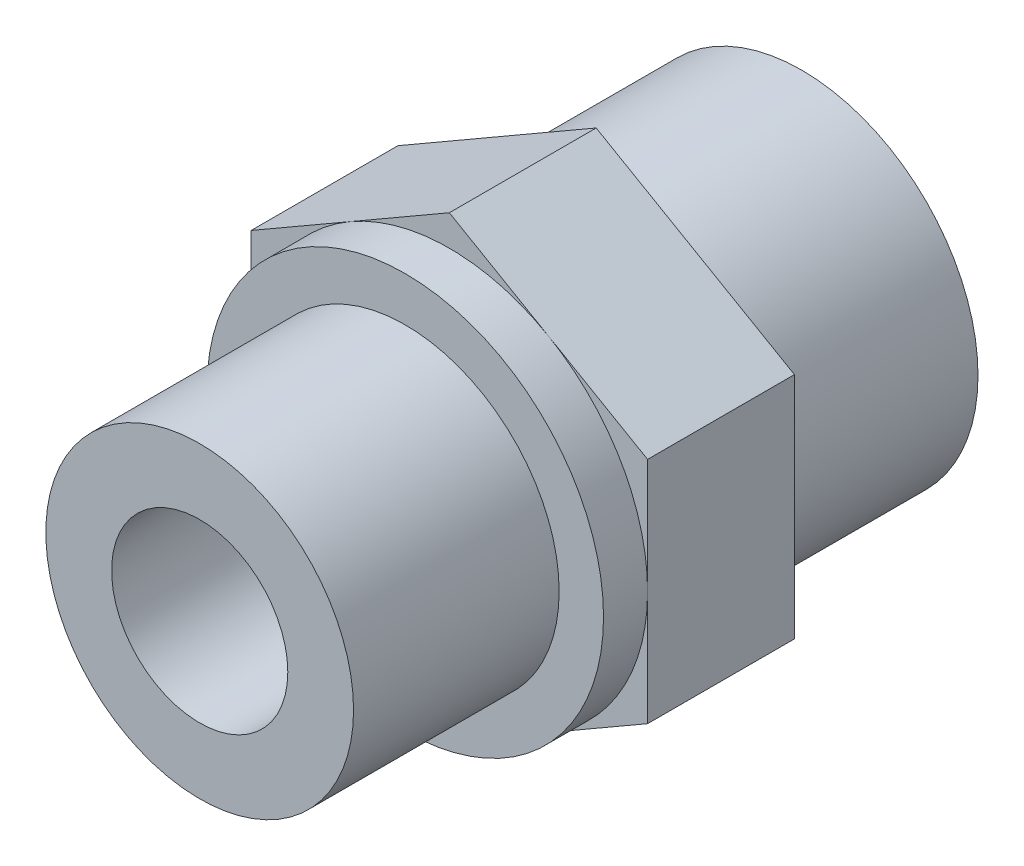
ISO-10303-21;
HEADER;
FILE_DESCRIPTION(('STEP AP214'),'2;1');
FILE_NAME('part.step','',(''),(''),'','','');
FILE_SCHEMA(('AUTOMOTIVE_DESIGN { 1 0 10303 214 1 1 1 1 }'));
ENDSEC;
DATA;
#1=APPLICATION_CONTEXT('core data for automotive mechanical design processes');
#2=APPLICATION_PROTOCOL_DEFINITION('international standard','automotive_design',2000,#1);
#3=PRODUCT_CONTEXT('',#1,'mechanical');
#4=PRODUCT('Part','Part','',(#3));
#5=PRODUCT_RELATED_PRODUCT_CATEGORY('part','',(#4));
#6=PRODUCT_DEFINITION_FORMATION('','',#4);
#7=PRODUCT_DEFINITION_CONTEXT('part definition',#1,'design');
#8=PRODUCT_DEFINITION('design','',#6,#7);
#9=PRODUCT_DEFINITION_SHAPE('','',#8);
#10=(LENGTH_UNIT() NAMED_UNIT(*) SI_UNIT(.MILLI.,.METRE.));
#11=(NAMED_UNIT(*) PLANE_ANGLE_UNIT() SI_UNIT($,.RADIAN.));
#12=(NAMED_UNIT(*) SI_UNIT($,.STERADIAN.) SOLID_ANGLE_UNIT());
#13=UNCERTAINTY_MEASURE_WITH_UNIT(LENGTH_MEASURE(1.E-05),#10,'distance_accuracy_value','');
#14=(GEOMETRIC_REPRESENTATION_CONTEXT(3) GLOBAL_UNCERTAINTY_ASSIGNED_CONTEXT((#13)) GLOBAL_UNIT_ASSIGNED_CONTEXT((#10,
#11,#12)) REPRESENTATION_CONTEXT('',''));
#15=CARTESIAN_POINT('',(0.,0.,0.));
#16=DIRECTION('',(0.,0.,1.));
#17=DIRECTION('',(1.,0.,0.));
#18=AXIS2_PLACEMENT_3D('',#15,#16,#17);
#19=CARTESIAN_POINT('',(-2.22044604925031E-13,1.4432899320127E-12,-14.0000000000002));
#20=DIRECTION('',(0.,0.,-1.));
#21=DIRECTION('',(-1.,0.,0.));
#22=AXIS2_PLACEMENT_3D('',#19,#20,#21);
#23=PLANE('',#22);
#24=CARTESIAN_POINT('',(-2.22044604925031E-13,1.4432899320127E-12,-14.0000000000002));
#25=DIRECTION('',(0.,0.,-1.));
#26=DIRECTION('',(-1.,0.,0.));
#27=AXIS2_PLACEMENT_3D('',#24,#25,#26);
#28=CIRCLE('',#27,12.);
#29=CARTESIAN_POINT('',(-12.0000000000002,1.4432899320127E-12,-14.0000000000002));
#30=VERTEX_POINT('',#29);
#31=EDGE_CURVE('E266',#30,#30,#28,.T.);
#32=ORIENTED_EDGE('',*,*,#31,.T.);
#33=EDGE_LOOP('',(#32));
#34=FACE_BOUND('',#33,.T.);
#35=CARTESIAN_POINT('',(-2.22044604925031E-13,1.4432899320127E-12,-14.0000000000002));
#36=DIRECTION('',(0.,0.,1.));
#37=DIRECTION('',(1.,0.,0.));
#38=AXIS2_PLACEMENT_3D('',#35,#36,#37);
#39=CIRCLE('',#38,9.15);
#40=CARTESIAN_POINT('',(9.14999999999978,1.4432899320127E-12,-14.0000000000002));
#41=VERTEX_POINT('',#40);
#42=EDGE_CURVE('E274',#41,#41,#39,.T.);
#43=ORIENTED_EDGE('',*,*,#42,.T.);
#44=EDGE_LOOP('',(#43));
#45=FACE_BOUND('',#44,.T.);
#46=ADVANCED_FACE('F34',(#34,#45),#23,.T.);
#47=CARTESIAN_POINT('',(2.22044604925031E-13,1.27675647831893E-12,-14.0000000000001));
#48=DIRECTION('',(0.,0.,1.));
#49=DIRECTION('',(1.,0.,0.));
#50=AXIS2_PLACEMENT_3D('',#47,#48,#49);
#51=CYLINDRICAL_SURFACE('',#50,6.);
#52=CARTESIAN_POINT('',(0.,1.60982338570648E-12,26.9999999999997));
#53=DIRECTION('',(0.,0.,1.));
#54=DIRECTION('',(1.,0.,0.));
#55=AXIS2_PLACEMENT_3D('',#52,#53,#54);
#56=CIRCLE('',#55,6.);
#57=CARTESIAN_POINT('',(6.,1.60982338570648E-12,26.9999999999997));
#58=VERTEX_POINT('',#57);
#59=EDGE_CURVE('E269',#58,#58,#56,.T.);
#60=ORIENTED_EDGE('',*,*,#59,.T.);
#61=EDGE_LOOP('',(#60));
#62=FACE_BOUND('',#61,.T.);
#63=CARTESIAN_POINT('',(0.,1.72084568816899E-12,-5.50000000000001));
#64=DIRECTION('',(0.,0.,-1.));
#65=DIRECTION('',(-1.,0.,0.));
#66=AXIS2_PLACEMENT_3D('',#63,#64,#65);
#67=CIRCLE('',#66,6.);
#68=CARTESIAN_POINT('',(-6.,1.72084568816899E-12,-5.50000000000001));
#69=VERTEX_POINT('',#68);
#70=EDGE_CURVE('E38',#69,#69,#67,.F.);
#71=ORIENTED_EDGE('',*,*,#70,.F.);
#72=EDGE_LOOP('',(#71));
#73=FACE_BOUND('',#72,.T.);
#74=ADVANCED_FACE('F226',(#62,#73),#51,.F.);
#75=CARTESIAN_POINT('',(-13.5000000000001,23.3826859021811,-4.44089209850063E-13));
#76=DIRECTION('',(0.,0.,1.));
#77=DIRECTION('',(1.,0.,0.));
#78=AXIS2_PLACEMENT_3D('',#75,#76,#77);
#79=PLANE('',#78);
#80=DIRECTION('',(-0.866025403784438,0.499999999999998,0.));
#81=VECTOR('',#80,1.);
#82=CARTESIAN_POINT('',(13.4999999999998,7.79422863406098,-6.66133814775094E-13));
#83=LINE('',#82,#81);
#84=CARTESIAN_POINT('',(13.4999999999998,7.79422863406098,-6.66133814775094E-13));
#85=VERTEX_POINT('',#84);
#86=CARTESIAN_POINT('',(2.22044604925031E-13,15.5884572681207,-6.10622663543836E-13));
#87=VERTEX_POINT('',#86);
#88=EDGE_CURVE('E157',#85,#87,#83,.T.);
#89=ORIENTED_EDGE('',*,*,#88,.F.);
#90=DIRECTION('',(0.,0.999999999999997,0.));
#91=VECTOR('',#90,1.);
#92=CARTESIAN_POINT('',(13.4999999999995,-7.79422863405849,-3.33066907387547E-13));
#93=LINE('',#92,#91);
#94=CARTESIAN_POINT('',(13.4999999999995,-7.79422863405849,-3.33066907387547E-13));
#95=VERTEX_POINT('',#94);
#96=EDGE_CURVE('E168',#95,#85,#93,.T.);
#97=ORIENTED_EDGE('',*,*,#96,.F.);
#98=DIRECTION('',(0.866025403784439,0.499999999999997,0.));
#99=VECTOR('',#98,1.);
#100=CARTESIAN_POINT('',(-4.44089209850063E-13,-15.588457268119,-6.10622663543836E-13));
#101=LINE('',#100,#99);
#102=CARTESIAN_POINT('',(-4.44089209850063E-13,-15.588457268119,-6.10622663543836E-13));
#103=VERTEX_POINT('',#102);
#104=EDGE_CURVE('E166',#103,#95,#101,.T.);
#105=ORIENTED_EDGE('',*,*,#104,.F.);
#106=DIRECTION('',(0.866025403784439,-0.499999999999999,0.));
#107=VECTOR('',#106,1.);
#108=CARTESIAN_POINT('',(-13.5000000000003,-7.7942286340586,-5.55111512312578E-13));
#109=LINE('',#108,#107);
#110=CARTESIAN_POINT('',(-13.5000000000003,-7.7942286340586,-5.55111512312578E-13));
#111=VERTEX_POINT('',#110);
#112=EDGE_CURVE('E164',#111,#103,#109,.T.);
#113=ORIENTED_EDGE('',*,*,#112,.F.);
#114=DIRECTION('',(0.,-0.999999999999997,0.));
#115=VECTOR('',#114,1.);
#116=CARTESIAN_POINT('',(-13.4999999999998,7.79422863406137,-3.33066907387547E-13));
#117=LINE('',#116,#115);
#118=CARTESIAN_POINT('',(-13.4999999999998,7.79422863406137,-3.33066907387547E-13));
#119=VERTEX_POINT('',#118);
#120=EDGE_CURVE('E162',#119,#111,#117,.T.);
#121=ORIENTED_EDGE('',*,*,#120,.F.);
#122=DIRECTION('',(-0.866025403784438,-0.499999999999998,0.));
#123=VECTOR('',#122,1.);
#124=CARTESIAN_POINT('',(2.22044604925031E-13,15.5884572681207,-6.10622663543836E-13));
#125=LINE('',#124,#123);
#126=EDGE_CURVE('E160',#87,#119,#125,.T.);
#127=ORIENTED_EDGE('',*,*,#126,.F.);
#128=EDGE_LOOP('',(#89,#97,#105,#113,#121,#127));
#129=FACE_BOUND('',#128,.T.);
#130=CARTESIAN_POINT('',(-2.22044604925031E-13,9.43689570931383E-13,-1.66533453693773E-13));
#131=DIRECTION('',(0.,0.,1.));
#132=DIRECTION('',(1.,0.,0.));
#133=AXIS2_PLACEMENT_3D('',#130,#131,#132);
#134=CIRCLE('',#133,12.);
#135=CARTESIAN_POINT('',(11.9999999999998,9.43689570931383E-13,-1.66734131172478E-13));
#136=VERTEX_POINT('',#135);
#137=EDGE_CURVE('E11',#136,#136,#134,.F.);
#138=ORIENTED_EDGE('',*,*,#137,.F.);
#139=EDGE_LOOP('',(#138));
#140=FACE_BOUND('',#139,.T.);
#141=ADVANCED_FACE('F192',(#129,#140),#79,.F.);
#142=CARTESIAN_POINT('',(2.22044604925031E-13,1.27675647831893E-12,13.));
#143=DIRECTION('',(0.,0.,1.));
#144=DIRECTION('',(1.,0.,0.));
#145=AXIS2_PLACEMENT_3D('',#142,#143,#144);
#146=PLANE('',#145);
#147=CARTESIAN_POINT('',(2.22044604925031E-13,1.27675647831893E-12,13.));
#148=DIRECTION('',(0.,0.,1.));
#149=DIRECTION('',(1.,0.,0.));
#150=AXIS2_PLACEMENT_3D('',#147,#148,#149);
#151=CIRCLE('',#150,13.5);
#152=CARTESIAN_POINT('',(13.5000000000002,1.27675647831893E-12,13.));
#153=VERTEX_POINT('',#152);
#154=EDGE_CURVE('E129',#153,#153,#151,.T.);
#155=ORIENTED_EDGE('',*,*,#154,.T.);
#156=EDGE_LOOP('',(#155));
#157=FACE_BOUND('',#156,.T.);
#158=CARTESIAN_POINT('',(2.22044604925031E-13,1.27675647831893E-12,13.));
#159=DIRECTION('',(0.,0.,1.));
#160=DIRECTION('',(1.,0.,0.));
#161=AXIS2_PLACEMENT_3D('',#158,#159,#160);
#162=CIRCLE('',#161,10.4775);
#163=CARTESIAN_POINT('',(10.4775000000002,1.27675647831893E-12,13.));
#164=VERTEX_POINT('',#163);
#165=EDGE_CURVE('E264',#164,#164,#162,.T.);
#166=ORIENTED_EDGE('',*,*,#165,.F.);
#167=EDGE_LOOP('',(#166));
#168=FACE_BOUND('',#167,.T.);
#169=ADVANCED_FACE('F251',(#157,#168),#146,.T.);
#170=CARTESIAN_POINT('',(-13.5000000000007,23.3826859021808,9.99999999999945));
#171=DIRECTION('',(0.,0.,1.));
#172=DIRECTION('',(1.,0.,0.));
#173=AXIS2_PLACEMENT_3D('',#170,#171,#172);
#174=PLANE('',#173);
#175=CARTESIAN_POINT('',(-2.22044604925031E-13,8.88178419700125E-13,9.99999999999973));
#176=DIRECTION('',(0.,0.,1.));
#177=DIRECTION('',(1.,0.,0.));
#178=AXIS2_PLACEMENT_3D('',#175,#176,#177);
#179=CIRCLE('',#178,13.5);
#180=CARTESIAN_POINT('',(13.4999999999992,1.11022302462516E-12,9.99999999999951));
#181=VERTEX_POINT('',#180);
#182=CARTESIAN_POINT('',(6.74999999999937,11.6913429510913,9.99999999999945));
#183=VERTEX_POINT('',#182);
#184=EDGE_CURVE('E124',#181,#183,#179,.T.);
#185=ORIENTED_EDGE('',*,*,#184,.F.);
#186=DIRECTION('',(0.,0.999999999999997,0.));
#187=VECTOR('',#186,1.);
#188=CARTESIAN_POINT('',(13.5000000000001,-7.79422863405899,9.99999999999968));
#189=LINE('',#188,#187);
#190=CARTESIAN_POINT('',(13.4999999999993,7.79422863406093,9.99999999999934));
#191=VERTEX_POINT('',#190);
#192=EDGE_CURVE('E113',#181,#191,#189,.T.);
#193=ORIENTED_EDGE('',*,*,#192,.T.);
#194=DIRECTION('',(-0.866025403784438,0.499999999999998,0.));
#195=VECTOR('',#194,1.);
#196=CARTESIAN_POINT('',(13.4999999999993,7.79422863406093,9.99999999999934));
#197=LINE('',#196,#195);
#198=EDGE_CURVE('E126',#191,#183,#197,.T.);
#199=ORIENTED_EDGE('',*,*,#198,.T.);
#200=EDGE_LOOP('',(#185,#193,#199));
#201=FACE_BOUND('',#200,.T.);
#202=ADVANCED_FACE('F125',(#201),#174,.T.);
#203=CARTESIAN_POINT('',(-6.7500000000007,11.6913429510908,9.99999999999918));
#204=VERTEX_POINT('',#203);
#205=EDGE_CURVE('E43',#183,#204,#179,.T.);
#206=ORIENTED_EDGE('',*,*,#205,.F.);
#207=CARTESIAN_POINT('',(-2.22044604925031E-13,15.5884572681211,9.99999999999945));
#208=VERTEX_POINT('',#207);
#209=EDGE_CURVE('E144',#183,#208,#197,.T.);
#210=ORIENTED_EDGE('',*,*,#209,.T.);
#211=DIRECTION('',(-0.866025403784438,-0.499999999999998,0.));
#212=VECTOR('',#211,1.);
#213=CARTESIAN_POINT('',(-2.22044604925031E-13,15.5884572681211,9.99999999999945));
#214=LINE('',#213,#212);
#215=EDGE_CURVE('E145',#208,#204,#214,.T.);
#216=ORIENTED_EDGE('',*,*,#215,.T.);
#217=EDGE_LOOP('',(#206,#210,#216));
#218=FACE_BOUND('',#217,.T.);
#219=ADVANCED_FACE('F210',(#218),#174,.T.);
#220=CARTESIAN_POINT('',(-13.5000000000001,9.43689570931383E-13,9.99999999999984));
#221=VERTEX_POINT('',#220);
#222=EDGE_CURVE('E207',#204,#221,#179,.T.);
#223=ORIENTED_EDGE('',*,*,#222,.F.);
#224=CARTESIAN_POINT('',(-13.5000000000007,7.79422863406093,9.99999999999956));
#225=VERTEX_POINT('',#224);
#226=EDGE_CURVE('E143',#204,#225,#214,.T.);
#227=ORIENTED_EDGE('',*,*,#226,.T.);
#228=DIRECTION('',(0.,-0.999999999999997,0.));
#229=VECTOR('',#228,1.);
#230=CARTESIAN_POINT('',(-13.5000000000007,7.79422863406093,9.99999999999956));
#231=LINE('',#230,#229);
#232=EDGE_CURVE('E149',#225,#221,#231,.T.);
#233=ORIENTED_EDGE('',*,*,#232,.T.);
#234=EDGE_LOOP('',(#223,#227,#233));
#235=FACE_BOUND('',#234,.T.);
#236=ADVANCED_FACE('F216',(#235),#174,.T.);
#237=CARTESIAN_POINT('',(-6.75000000000092,-11.6913429510886,9.99999999999956));
#238=VERTEX_POINT('',#237);
#239=EDGE_CURVE('E135',#221,#238,#179,.T.);
#240=ORIENTED_EDGE('',*,*,#239,.F.);
#241=CARTESIAN_POINT('',(-13.5000000000005,-7.79422863405849,9.9999999999994));
#242=VERTEX_POINT('',#241);
#243=EDGE_CURVE('E148',#221,#242,#231,.T.);
#244=ORIENTED_EDGE('',*,*,#243,.T.);
#245=DIRECTION('',(0.866025403784439,-0.499999999999999,0.));
#246=VECTOR('',#245,1.);
#247=CARTESIAN_POINT('',(-13.5000000000005,-7.79422863405849,9.9999999999994));
#248=LINE('',#247,#246);
#249=EDGE_CURVE('E153',#242,#238,#248,.T.);
#250=ORIENTED_EDGE('',*,*,#249,.T.);
#251=EDGE_LOOP('',(#240,#244,#250));
#252=FACE_BOUND('',#251,.T.);
#253=ADVANCED_FACE('F205',(#252),#174,.T.);
#254=CARTESIAN_POINT('',(6.74999999999915,-11.6913429510884,9.99999999999968));
#255=VERTEX_POINT('',#254);
#256=EDGE_CURVE('E58',#238,#255,#179,.T.);
#257=ORIENTED_EDGE('',*,*,#256,.F.);
#258=CARTESIAN_POINT('',(-8.88178419700125E-13,-15.5884572681189,9.99999999999945));
#259=VERTEX_POINT('',#258);
#260=EDGE_CURVE('E152',#238,#259,#248,.T.);
#261=ORIENTED_EDGE('',*,*,#260,.T.);
#262=DIRECTION('',(0.866025403784439,0.499999999999997,0.));
#263=VECTOR('',#262,1.);
#264=CARTESIAN_POINT('',(-8.88178419700125E-13,-15.5884572681189,9.99999999999945));
#265=LINE('',#264,#263);
#266=EDGE_CURVE('E122',#259,#255,#265,.T.);
#267=ORIENTED_EDGE('',*,*,#266,.T.);
#268=EDGE_LOOP('',(#257,#261,#267));
#269=FACE_BOUND('',#268,.T.);
#270=ADVANCED_FACE('F203',(#269),#174,.T.);
#271=CARTESIAN_POINT('',(13.4999999999993,7.79422863406093,9.99999999999934));
#272=DIRECTION('',(-0.5,-0.866025403784436,0.));
#273=DIRECTION('',(0.866025403784438,-0.499999999999998,0.));
#274=AXIS2_PLACEMENT_3D('',#271,#272,#273);
#275=PLANE('',#274);
#276=ORIENTED_EDGE('',*,*,#88,.T.);
#277=DIRECTION('',(0.,0.,-1.));
#278=VECTOR('',#277,1.);
#279=CARTESIAN_POINT('',(-2.22044604925031E-13,15.5884572681211,9.99999999999945));
#280=LINE('',#279,#278);
#281=EDGE_CURVE('E134',#208,#87,#280,.T.);
#282=ORIENTED_EDGE('',*,*,#281,.F.);
#283=ORIENTED_EDGE('',*,*,#209,.F.);
#284=ORIENTED_EDGE('',*,*,#198,.F.);
#285=DIRECTION('',(0.,0.,-1.));
#286=VECTOR('',#285,1.);
#287=CARTESIAN_POINT('',(13.4999999999993,7.79422863406093,9.99999999999934));
#288=LINE('',#287,#286);
#289=EDGE_CURVE('E112',#191,#85,#288,.T.);
#290=ORIENTED_EDGE('',*,*,#289,.T.);
#291=EDGE_LOOP('',(#276,#282,#283,#284,#290));
#292=FACE_BOUND('',#291,.T.);
#293=ADVANCED_FACE('F36',(#292),#275,.F.);
#294=CARTESIAN_POINT('',(-2.22044604925031E-13,15.5884572681211,9.99999999999945));
#295=DIRECTION('',(0.499999999999999,-0.866025403784436,0.));
#296=DIRECTION('',(0.866025403784438,0.499999999999998,0.));
#297=AXIS2_PLACEMENT_3D('',#294,#295,#296);
#298=PLANE('',#297);
#299=ORIENTED_EDGE('',*,*,#126,.T.);
#300=DIRECTION('',(0.,0.,-1.));
#301=VECTOR('',#300,1.);
#302=CARTESIAN_POINT('',(-13.5000000000007,7.79422863406093,9.99999999999956));
#303=LINE('',#302,#301);
#304=EDGE_CURVE('E137',#225,#119,#303,.T.);
#305=ORIENTED_EDGE('',*,*,#304,.F.);
#306=ORIENTED_EDGE('',*,*,#226,.F.);
#307=ORIENTED_EDGE('',*,*,#215,.F.);
#308=ORIENTED_EDGE('',*,*,#281,.T.);
#309=EDGE_LOOP('',(#299,#305,#306,#307,#308));
#310=FACE_BOUND('',#309,.T.);
#311=ADVANCED_FACE('F214',(#310),#298,.F.);
#312=CARTESIAN_POINT('',(-13.5000000000007,7.79422863406093,9.99999999999956));
#313=DIRECTION('',(1.,0.,0.));
#314=DIRECTION('',(0.,0.,-1.));
#315=AXIS2_PLACEMENT_3D('',#312,#313,#314);
#316=PLANE('',#315);
#317=ORIENTED_EDGE('',*,*,#120,.T.);
#318=DIRECTION('',(0.,0.,-1.));
#319=VECTOR('',#318,1.);
#320=CARTESIAN_POINT('',(-13.5000000000005,-7.79422863405849,9.9999999999994));
#321=LINE('',#320,#319);
#322=EDGE_CURVE('E176',#242,#111,#321,.T.);
#323=ORIENTED_EDGE('',*,*,#322,.F.);
#324=ORIENTED_EDGE('',*,*,#243,.F.);
#325=ORIENTED_EDGE('',*,*,#232,.F.);
#326=ORIENTED_EDGE('',*,*,#304,.T.);
#327=EDGE_LOOP('',(#317,#323,#324,#325,#326));
#328=FACE_BOUND('',#327,.T.);
#329=ADVANCED_FACE('F184',(#328),#316,.F.);
#330=CARTESIAN_POINT('',(-13.5000000000005,-7.79422863405849,9.9999999999994));
#331=DIRECTION('',(0.5,0.866025403784436,0.));
#332=DIRECTION('',(-0.866025403784439,0.499999999999999,0.));
#333=AXIS2_PLACEMENT_3D('',#330,#331,#332);
#334=PLANE('',#333);
#335=ORIENTED_EDGE('',*,*,#112,.T.);
#336=DIRECTION('',(0.,0.,-1.));
#337=VECTOR('',#336,1.);
#338=CARTESIAN_POINT('',(-8.88178419700125E-13,-15.5884572681189,9.99999999999945));
#339=LINE('',#338,#337);
#340=EDGE_CURVE('E173',#259,#103,#339,.T.);
#341=ORIENTED_EDGE('',*,*,#340,.F.);
#342=ORIENTED_EDGE('',*,*,#260,.F.);
#343=ORIENTED_EDGE('',*,*,#249,.F.);
#344=ORIENTED_EDGE('',*,*,#322,.T.);
#345=EDGE_LOOP('',(#335,#341,#342,#343,#344));
#346=FACE_BOUND('',#345,.T.);
#347=ADVANCED_FACE('F198',(#346),#334,.F.);
#348=CARTESIAN_POINT('',(-8.88178419700125E-13,-15.5884572681189,9.99999999999945));
#349=DIRECTION('',(-0.499999999999999,0.866025403784436,0.));
#350=DIRECTION('',(-0.866025403784439,-0.499999999999997,0.));
#351=AXIS2_PLACEMENT_3D('',#348,#349,#350);
#352=PLANE('',#351);
#353=ORIENTED_EDGE('',*,*,#104,.T.);
#354=DIRECTION('',(0.,0.,-1.));
#355=VECTOR('',#354,1.);
#356=CARTESIAN_POINT('',(13.5000000000001,-7.79422863405899,9.99999999999968));
#357=LINE('',#356,#355);
#358=CARTESIAN_POINT('',(13.5000000000001,-7.79422863405899,9.99999999999968));
#359=VERTEX_POINT('',#358);
#360=EDGE_CURVE('E171',#359,#95,#357,.T.);
#361=ORIENTED_EDGE('',*,*,#360,.F.);
#362=EDGE_CURVE('E108',#255,#359,#265,.T.);
#363=ORIENTED_EDGE('',*,*,#362,.F.);
#364=ORIENTED_EDGE('',*,*,#266,.F.);
#365=ORIENTED_EDGE('',*,*,#340,.T.);
#366=EDGE_LOOP('',(#353,#361,#363,#364,#365));
#367=FACE_BOUND('',#366,.T.);
#368=ADVANCED_FACE('F202',(#367),#352,.F.);
#369=CARTESIAN_POINT('',(13.5000000000001,-7.79422863405899,9.99999999999968));
#370=DIRECTION('',(-1.,0.,0.));
#371=DIRECTION('',(0.,-0.999999999999997,0.));
#372=AXIS2_PLACEMENT_3D('',#369,#370,#371);
#373=PLANE('',#372);
#374=ORIENTED_EDGE('',*,*,#96,.T.);
#375=ORIENTED_EDGE('',*,*,#289,.F.);
#376=ORIENTED_EDGE('',*,*,#192,.F.);
#377=EDGE_CURVE('E105',#359,#181,#189,.T.);
#378=ORIENTED_EDGE('',*,*,#377,.F.);
#379=ORIENTED_EDGE('',*,*,#360,.T.);
#380=EDGE_LOOP('',(#374,#375,#376,#378,#379));
#381=FACE_BOUND('',#380,.T.);
#382=ADVANCED_FACE('F117',(#381),#373,.F.);
#383=EDGE_CURVE('E50',#255,#181,#179,.T.);
#384=ORIENTED_EDGE('',*,*,#383,.F.);
#385=ORIENTED_EDGE('',*,*,#362,.T.);
#386=ORIENTED_EDGE('',*,*,#377,.T.);
#387=EDGE_LOOP('',(#384,#385,#386));
#388=FACE_BOUND('',#387,.T.);
#389=ADVANCED_FACE('F107',(#388),#174,.T.);
#390=CARTESIAN_POINT('',(2.22044604925031E-13,1.27675647831893E-12,13.));
#391=DIRECTION('',(0.,0.,-1.));
#392=DIRECTION('',(-1.,0.,0.));
#393=AXIS2_PLACEMENT_3D('',#390,#391,#392);
#394=CYLINDRICAL_SURFACE('',#393,13.5);
#395=ORIENTED_EDGE('',*,*,#154,.F.);
#396=EDGE_LOOP('',(#395));
#397=FACE_BOUND('',#396,.T.);
#398=ORIENTED_EDGE('',*,*,#184,.T.);
#399=ORIENTED_EDGE('',*,*,#205,.T.);
#400=ORIENTED_EDGE('',*,*,#222,.T.);
#401=ORIENTED_EDGE('',*,*,#239,.T.);
#402=ORIENTED_EDGE('',*,*,#256,.T.);
#403=ORIENTED_EDGE('',*,*,#383,.T.);
#404=EDGE_LOOP('',(#398,#399,#400,#401,#402,#403));
#405=FACE_BOUND('',#404,.T.);
#406=ADVANCED_FACE('F132',(#397,#405),#394,.T.);
#407=CARTESIAN_POINT('',(0.,1.60982338570648E-12,26.9999999999997));
#408=DIRECTION('',(0.,0.,-1.));
#409=DIRECTION('',(-1.,0.,0.));
#410=AXIS2_PLACEMENT_3D('',#407,#408,#409);
#411=CYLINDRICAL_SURFACE('',#410,10.4775);
#412=CARTESIAN_POINT('',(0.,1.60982338570648E-12,26.9999999999997));
#413=DIRECTION('',(0.,0.,1.));
#414=DIRECTION('',(1.,0.,0.));
#415=AXIS2_PLACEMENT_3D('',#412,#413,#414);
#416=CIRCLE('',#415,10.4775);
#417=CARTESIAN_POINT('',(10.4775,1.60982338570648E-12,26.9999999999997));
#418=VERTEX_POINT('',#417);
#419=EDGE_CURVE('E130',#418,#418,#416,.T.);
#420=ORIENTED_EDGE('',*,*,#419,.F.);
#421=EDGE_LOOP('',(#420));
#422=FACE_BOUND('',#421,.T.);
#423=ORIENTED_EDGE('',*,*,#165,.T.);
#424=EDGE_LOOP('',(#423));
#425=FACE_BOUND('',#424,.T.);
#426=ADVANCED_FACE('F246',(#422,#425),#411,.T.);
#427=CARTESIAN_POINT('',(0.,1.60982338570648E-12,26.9999999999997));
#428=DIRECTION('',(0.,0.,1.));
#429=DIRECTION('',(1.,0.,0.));
#430=AXIS2_PLACEMENT_3D('',#427,#428,#429);
#431=PLANE('',#430);
#432=ORIENTED_EDGE('',*,*,#59,.F.);
#433=EDGE_LOOP('',(#432));
#434=FACE_BOUND('',#433,.T.);
#435=ORIENTED_EDGE('',*,*,#419,.T.);
#436=EDGE_LOOP('',(#435));
#437=FACE_BOUND('',#436,.T.);
#438=ADVANCED_FACE('F242',(#434,#437),#431,.T.);
#439=CARTESIAN_POINT('',(-2.22044604925031E-13,1.4432899320127E-12,-14.0000000000002));
#440=DIRECTION('',(0.,0.,1.));
#441=DIRECTION('',(1.,0.,0.));
#442=AXIS2_PLACEMENT_3D('',#439,#440,#441);
#443=CYLINDRICAL_SURFACE('',#442,12.);
#444=ORIENTED_EDGE('',*,*,#31,.F.);
#445=EDGE_LOOP('',(#444));
#446=FACE_BOUND('',#445,.T.);
#447=ORIENTED_EDGE('',*,*,#137,.T.);
#448=EDGE_LOOP('',(#447));
#449=FACE_BOUND('',#448,.T.);
#450=ADVANCED_FACE('F238',(#446,#449),#443,.T.);
#451=CARTESIAN_POINT('',(-4.44089209850063E-13,8.00000000000156,-5.50000000000073));
#452=DIRECTION('',(0.,0.,-1.));
#453=DIRECTION('',(-1.,0.,0.));
#454=AXIS2_PLACEMENT_3D('',#451,#452,#453);
#455=PLANE('',#454);
#456=CARTESIAN_POINT('',(0.,1.72084568816899E-12,-5.50000000000001));
#457=DIRECTION('',(0.,0.,1.));
#458=DIRECTION('',(1.,0.,0.));
#459=AXIS2_PLACEMENT_3D('',#456,#457,#458);
#460=CIRCLE('',#459,8.);
#461=CARTESIAN_POINT('',(8.,1.72084568816899E-12,-5.50000000000001));
#462=VERTEX_POINT('',#461);
#463=EDGE_CURVE('E280',#462,#462,#460,.T.);
#464=ORIENTED_EDGE('',*,*,#463,.F.);
#465=EDGE_LOOP('',(#464));
#466=FACE_BOUND('',#465,.T.);
#467=ORIENTED_EDGE('',*,*,#70,.T.);
#468=EDGE_LOOP('',(#467));
#469=FACE_BOUND('',#468,.T.);
#470=ADVANCED_FACE('F241',(#466,#469),#455,.T.);
#471=CARTESIAN_POINT('',(-2.22044604925031E-13,1.4432899320127E-12,-14.0000000000002));
#472=DIRECTION('',(0.,0.,-1.));
#473=DIRECTION('',(-1.,0.,0.));
#474=AXIS2_PLACEMENT_3D('',#471,#472,#473);
#475=CONICAL_SURFACE('',#474,9.15,0.209439510239313);
#476=CARTESIAN_POINT('',(-4.44089209850063E-13,1.77635683940025E-12,-8.5896753740996));
#477=DIRECTION('',(0.,0.,1.));
#478=DIRECTION('',(1.,0.,0.));
#479=AXIS2_PLACEMENT_3D('',#476,#477,#478);
#480=CIRCLE('',#479,8.);
#481=CARTESIAN_POINT('',(7.99999999999956,1.77635683940025E-12,-8.5896753740996));
#482=VERTEX_POINT('',#481);
#483=EDGE_CURVE('E277',#482,#482,#480,.T.);
#484=ORIENTED_EDGE('',*,*,#483,.T.);
#485=EDGE_LOOP('',(#484));
#486=FACE_BOUND('',#485,.T.);
#487=ORIENTED_EDGE('',*,*,#42,.F.);
#488=EDGE_LOOP('',(#487));
#489=FACE_BOUND('',#488,.T.);
#490=ADVANCED_FACE('F289',(#486,#489),#475,.F.);
#491=CARTESIAN_POINT('',(-2.22044604925031E-13,9.43689570931383E-13,-1.66533453693773E-13));
#492=DIRECTION('',(0.,0.,1.));
#493=DIRECTION('',(1.,0.,0.));
#494=AXIS2_PLACEMENT_3D('',#491,#492,#493);
#495=CYLINDRICAL_SURFACE('',#494,8.);
#496=ORIENTED_EDGE('',*,*,#463,.T.);
#497=EDGE_LOOP('',(#496));
#498=FACE_BOUND('',#497,.T.);
#499=ORIENTED_EDGE('',*,*,#483,.F.);
#500=EDGE_LOOP('',(#499));
#501=FACE_BOUND('',#500,.T.);
#502=ADVANCED_FACE('F284',(#498,#501),#495,.F.);
#503=CLOSED_SHELL('',(#46,#74,#141,#169,#202,#219,#236,#253,#270,#293,#311,#329,#347,#368,#382,
#389,#406,#426,#438,#450,#470,#490,#502));
#504=MANIFOLD_SOLID_BREP('B2',#503);
#505=ADVANCED_BREP_SHAPE_REPRESENTATION('',(#18,#504),#14);
#506=SHAPE_DEFINITION_REPRESENTATION(#9,#505);
ENDSEC;
END-ISO-10303-21;
